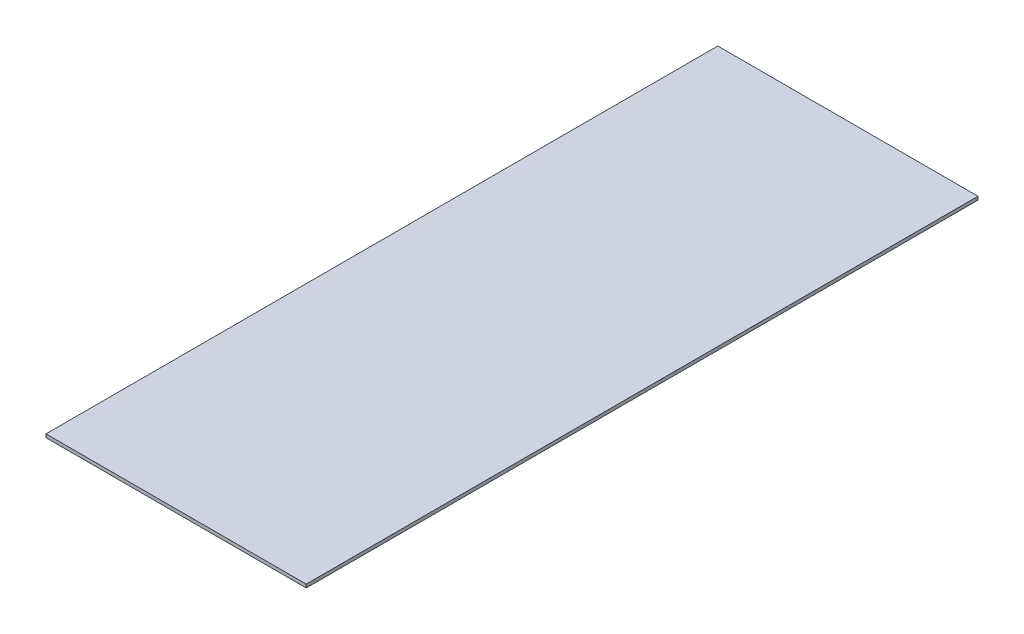
ISO-10303-21;
HEADER;
FILE_DESCRIPTION(('STEP AP214'),'2;1');
FILE_NAME('part.step','',(''),(''),'','','');
FILE_SCHEMA(('AUTOMOTIVE_DESIGN { 1 0 10303 214 1 1 1 1 }'));
ENDSEC;
DATA;
#1=APPLICATION_CONTEXT('core data for automotive mechanical design processes');
#2=APPLICATION_PROTOCOL_DEFINITION('international standard','automotive_design',2000,#1);
#3=PRODUCT_CONTEXT('',#1,'mechanical');
#4=PRODUCT('Part','Part','',(#3));
#5=PRODUCT_RELATED_PRODUCT_CATEGORY('part','',(#4));
#6=PRODUCT_DEFINITION_FORMATION('','',#4);
#7=PRODUCT_DEFINITION_CONTEXT('part definition',#1,'design');
#8=PRODUCT_DEFINITION('design','',#6,#7);
#9=PRODUCT_DEFINITION_SHAPE('','',#8);
#10=(LENGTH_UNIT() NAMED_UNIT(*) SI_UNIT(.MILLI.,.METRE.));
#11=(NAMED_UNIT(*) PLANE_ANGLE_UNIT() SI_UNIT($,.RADIAN.));
#12=(NAMED_UNIT(*) SI_UNIT($,.STERADIAN.) SOLID_ANGLE_UNIT());
#13=UNCERTAINTY_MEASURE_WITH_UNIT(LENGTH_MEASURE(1.E-05),#10,'distance_accuracy_value','');
#14=(GEOMETRIC_REPRESENTATION_CONTEXT(3) GLOBAL_UNCERTAINTY_ASSIGNED_CONTEXT((#13)) GLOBAL_UNIT_ASSIGNED_CONTEXT((#10,
#11,#12)) REPRESENTATION_CONTEXT('',''));
#15=CARTESIAN_POINT('',(0.,0.,0.));
#16=DIRECTION('',(0.,0.,1.));
#17=DIRECTION('',(1.,0.,0.));
#18=AXIS2_PLACEMENT_3D('',#15,#16,#17);
#19=CARTESIAN_POINT('',(115.47,3.,-298.1));
#20=DIRECTION('',(-1.,0.,0.));
#21=DIRECTION('',(0.,0.,1.));
#22=AXIS2_PLACEMENT_3D('',#19,#20,#21);
#23=PLANE('',#22);
#24=DIRECTION('',(0.,0.,-1.));
#25=VECTOR('',#24,1.);
#26=CARTESIAN_POINT('',(115.47,0.,-298.1));
#27=LINE('',#26,#25);
#28=CARTESIAN_POINT('',(115.47,0.,298.1));
#29=VERTEX_POINT('',#28);
#30=CARTESIAN_POINT('',(115.47,0.,-298.1));
#31=VERTEX_POINT('',#30);
#32=EDGE_CURVE('E96',#29,#31,#27,.T.);
#33=ORIENTED_EDGE('',*,*,#32,.T.);
#34=DIRECTION('',(0.,-1.,0.));
#35=VECTOR('',#34,1.);
#36=CARTESIAN_POINT('',(115.47,3.,-298.1));
#37=LINE('',#36,#35);
#38=CARTESIAN_POINT('',(115.47,3.,-298.1));
#39=VERTEX_POINT('',#38);
#40=EDGE_CURVE('E11',#39,#31,#37,.T.);
#41=ORIENTED_EDGE('',*,*,#40,.F.);
#42=DIRECTION('',(0.,0.,-1.));
#43=VECTOR('',#42,1.);
#44=CARTESIAN_POINT('',(115.47,3.,-298.1));
#45=LINE('',#44,#43);
#46=CARTESIAN_POINT('',(115.47,3.,298.1));
#47=VERTEX_POINT('',#46);
#48=EDGE_CURVE('E84',#47,#39,#45,.T.);
#49=ORIENTED_EDGE('',*,*,#48,.F.);
#50=DIRECTION('',(0.,-1.,0.));
#51=VECTOR('',#50,1.);
#52=CARTESIAN_POINT('',(115.47,3.,298.1));
#53=LINE('',#52,#51);
#54=EDGE_CURVE('E92',#47,#29,#53,.T.);
#55=ORIENTED_EDGE('',*,*,#54,.T.);
#56=EDGE_LOOP('',(#33,#41,#49,#55));
#57=FACE_BOUND('',#56,.T.);
#58=ADVANCED_FACE('F33',(#57),#23,.F.);
#59=CARTESIAN_POINT('',(-115.47,3.,-298.1));
#60=DIRECTION('',(0.,0.,1.));
#61=DIRECTION('',(1.,0.,0.));
#62=AXIS2_PLACEMENT_3D('',#59,#60,#61);
#63=PLANE('',#62);
#64=DIRECTION('',(-1.,0.,0.));
#65=VECTOR('',#64,1.);
#66=CARTESIAN_POINT('',(-115.47,0.,-298.1));
#67=LINE('',#66,#65);
#68=CARTESIAN_POINT('',(-115.47,0.,-298.1));
#69=VERTEX_POINT('',#68);
#70=EDGE_CURVE('E88',#31,#69,#67,.T.);
#71=ORIENTED_EDGE('',*,*,#70,.T.);
#72=DIRECTION('',(0.,-1.,0.));
#73=VECTOR('',#72,1.);
#74=CARTESIAN_POINT('',(-115.47,3.,-298.1));
#75=LINE('',#74,#73);
#76=CARTESIAN_POINT('',(-115.47,3.,-298.1));
#77=VERTEX_POINT('',#76);
#78=EDGE_CURVE('E41',#77,#69,#75,.T.);
#79=ORIENTED_EDGE('',*,*,#78,.F.);
#80=DIRECTION('',(-1.,0.,0.));
#81=VECTOR('',#80,1.);
#82=CARTESIAN_POINT('',(-115.47,3.,-298.1));
#83=LINE('',#82,#81);
#84=EDGE_CURVE('E79',#39,#77,#83,.T.);
#85=ORIENTED_EDGE('',*,*,#84,.F.);
#86=ORIENTED_EDGE('',*,*,#40,.T.);
#87=EDGE_LOOP('',(#71,#79,#85,#86));
#88=FACE_BOUND('',#87,.T.);
#89=ADVANCED_FACE('F87',(#88),#63,.F.);
#90=CARTESIAN_POINT('',(-115.47,3.,-298.1));
#91=DIRECTION('',(1.,0.,0.));
#92=DIRECTION('',(0.,0.,-1.));
#93=AXIS2_PLACEMENT_3D('',#90,#91,#92);
#94=PLANE('',#93);
#95=DIRECTION('',(0.,0.,1.));
#96=VECTOR('',#95,1.);
#97=CARTESIAN_POINT('',(-115.47,0.,-298.1));
#98=LINE('',#97,#96);
#99=CARTESIAN_POINT('',(-115.47,0.,298.1));
#100=VERTEX_POINT('',#99);
#101=EDGE_CURVE('E66',#69,#100,#98,.T.);
#102=ORIENTED_EDGE('',*,*,#101,.T.);
#103=DIRECTION('',(0.,-1.,0.));
#104=VECTOR('',#103,1.);
#105=CARTESIAN_POINT('',(-115.47,3.,298.1));
#106=LINE('',#105,#104);
#107=CARTESIAN_POINT('',(-115.47,3.,298.1));
#108=VERTEX_POINT('',#107);
#109=EDGE_CURVE('E89',#108,#100,#106,.T.);
#110=ORIENTED_EDGE('',*,*,#109,.F.);
#111=DIRECTION('',(0.,0.,1.));
#112=VECTOR('',#111,1.);
#113=CARTESIAN_POINT('',(-115.47,3.,-298.1));
#114=LINE('',#113,#112);
#115=EDGE_CURVE('E82',#77,#108,#114,.T.);
#116=ORIENTED_EDGE('',*,*,#115,.F.);
#117=ORIENTED_EDGE('',*,*,#78,.T.);
#118=EDGE_LOOP('',(#102,#110,#116,#117));
#119=FACE_BOUND('',#118,.T.);
#120=ADVANCED_FACE('F90',(#119),#94,.F.);
#121=CARTESIAN_POINT('',(-115.47,3.,298.1));
#122=DIRECTION('',(0.,0.,-1.));
#123=DIRECTION('',(-1.,0.,0.));
#124=AXIS2_PLACEMENT_3D('',#121,#122,#123);
#125=PLANE('',#124);
#126=DIRECTION('',(1.,0.,0.));
#127=VECTOR('',#126,1.);
#128=CARTESIAN_POINT('',(-115.47,0.,298.1));
#129=LINE('',#128,#127);
#130=EDGE_CURVE('E72',#100,#29,#129,.T.);
#131=ORIENTED_EDGE('',*,*,#130,.T.);
#132=ORIENTED_EDGE('',*,*,#54,.F.);
#133=DIRECTION('',(1.,0.,0.));
#134=VECTOR('',#133,1.);
#135=CARTESIAN_POINT('',(-115.47,3.,298.1));
#136=LINE('',#135,#134);
#137=EDGE_CURVE('E49',#108,#47,#136,.T.);
#138=ORIENTED_EDGE('',*,*,#137,.F.);
#139=ORIENTED_EDGE('',*,*,#109,.T.);
#140=EDGE_LOOP('',(#131,#132,#138,#139));
#141=FACE_BOUND('',#140,.T.);
#142=ADVANCED_FACE('F103',(#141),#125,.F.);
#143=CARTESIAN_POINT('',(0.,3.,0.));
#144=DIRECTION('',(0.,1.,0.));
#145=DIRECTION('',(0.,0.,1.));
#146=AXIS2_PLACEMENT_3D('',#143,#144,#145);
#147=PLANE('',#146);
#148=ORIENTED_EDGE('',*,*,#48,.T.);
#149=ORIENTED_EDGE('',*,*,#84,.T.);
#150=ORIENTED_EDGE('',*,*,#115,.T.);
#151=ORIENTED_EDGE('',*,*,#137,.T.);
#152=EDGE_LOOP('',(#148,#149,#150,#151));
#153=FACE_BOUND('',#152,.T.);
#154=ADVANCED_FACE('F80',(#153),#147,.T.);
#155=CARTESIAN_POINT('',(0.,0.,0.));
#156=DIRECTION('',(0.,1.,0.));
#157=DIRECTION('',(0.,0.,1.));
#158=AXIS2_PLACEMENT_3D('',#155,#156,#157);
#159=PLANE('',#158);
#160=ORIENTED_EDGE('',*,*,#32,.F.);
#161=ORIENTED_EDGE('',*,*,#130,.F.);
#162=ORIENTED_EDGE('',*,*,#101,.F.);
#163=ORIENTED_EDGE('',*,*,#70,.F.);
#164=EDGE_LOOP('',(#160,#161,#162,#163));
#165=FACE_BOUND('',#164,.T.);
#166=ADVANCED_FACE('F106',(#165),#159,.F.);
#167=CLOSED_SHELL('',(#58,#89,#120,#142,#154,#166));
#168=MANIFOLD_SOLID_BREP('B2',#167);
#169=ADVANCED_BREP_SHAPE_REPRESENTATION('',(#18,#168),#14);
#170=SHAPE_DEFINITION_REPRESENTATION(#9,#169);
ENDSEC;
END-ISO-10303-21;
